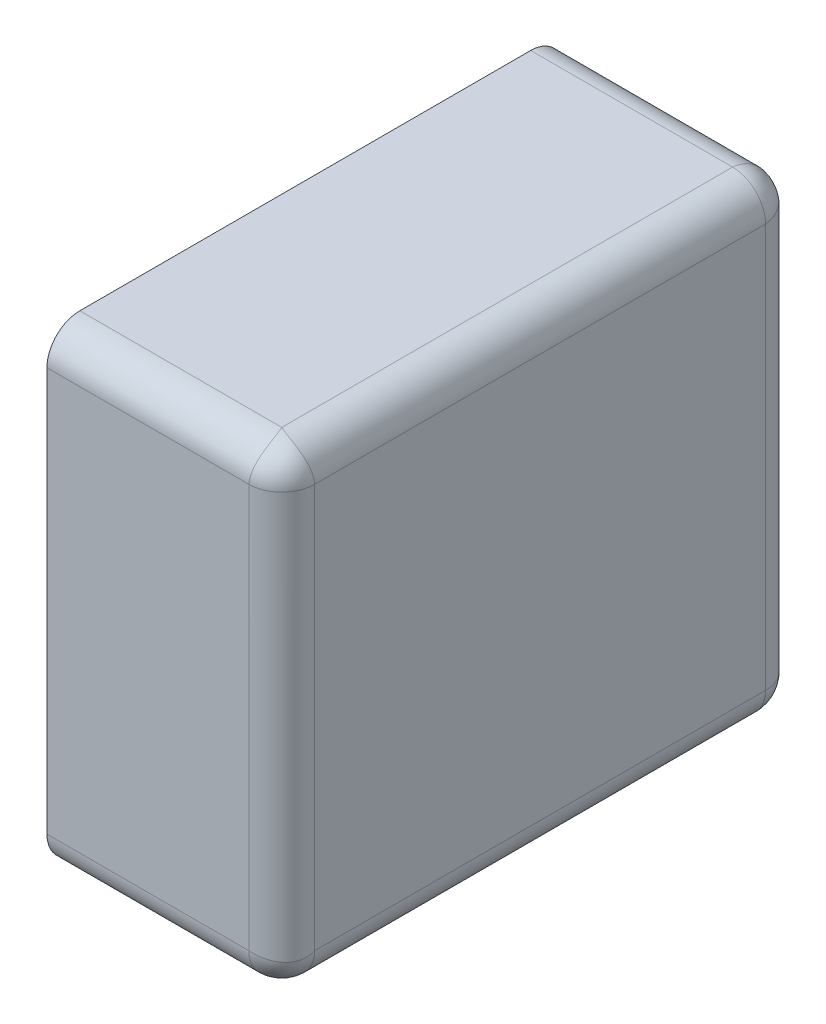
ISO-10303-21;
HEADER;
FILE_DESCRIPTION(('STEP AP214'),'2;1');
FILE_NAME('part.step','',(''),(''),'','','');
FILE_SCHEMA(('AUTOMOTIVE_DESIGN { 1 0 10303 214 1 1 1 1 }'));
ENDSEC;
DATA;
#1=APPLICATION_CONTEXT('core data for automotive mechanical design processes');
#2=APPLICATION_PROTOCOL_DEFINITION('international standard','automotive_design',2000,#1);
#3=PRODUCT_CONTEXT('',#1,'mechanical');
#4=PRODUCT('Part','Part','',(#3));
#5=PRODUCT_RELATED_PRODUCT_CATEGORY('part','',(#4));
#6=PRODUCT_DEFINITION_FORMATION('','',#4);
#7=PRODUCT_DEFINITION_CONTEXT('part definition',#1,'design');
#8=PRODUCT_DEFINITION('design','',#6,#7);
#9=PRODUCT_DEFINITION_SHAPE('','',#8);
#10=(LENGTH_UNIT() NAMED_UNIT(*) SI_UNIT(.MILLI.,.METRE.));
#11=(NAMED_UNIT(*) PLANE_ANGLE_UNIT() SI_UNIT($,.RADIAN.));
#12=(NAMED_UNIT(*) SI_UNIT($,.STERADIAN.) SOLID_ANGLE_UNIT());
#13=UNCERTAINTY_MEASURE_WITH_UNIT(LENGTH_MEASURE(1.E-05),#10,'distance_accuracy_value','');
#14=(GEOMETRIC_REPRESENTATION_CONTEXT(3) GLOBAL_UNCERTAINTY_ASSIGNED_CONTEXT((#13)) GLOBAL_UNIT_ASSIGNED_CONTEXT((#10,
#11,#12)) REPRESENTATION_CONTEXT('',''));
#15=CARTESIAN_POINT('',(0.,0.,0.));
#16=DIRECTION('',(0.,0.,1.));
#17=DIRECTION('',(1.,0.,0.));
#18=AXIS2_PLACEMENT_3D('',#15,#16,#17);
#19=CARTESIAN_POINT('',(0.465,-0.215,0.515));
#20=DIRECTION('',(-0.816496580927726,-0.408248290463863,0.408248290463864));
#21=DIRECTION('',(0.577350269189626,-0.577350269189626,0.577350269189626));
#22=AXIS2_PLACEMENT_3D('',#19,#20,#21);
#23=SPHERICAL_SURFACE('',#22,0.035);
#24=CARTESIAN_POINT('',(0.465,-0.215,0.515));
#25=DIRECTION('',(1.,0.,0.));
#26=DIRECTION('',(0.,-1.,0.));
#27=AXIS2_PLACEMENT_3D('',#24,#25,#26);
#28=CIRCLE('',#27,0.035);
#29=CARTESIAN_POINT('',(0.465,-0.215,0.55));
#30=VERTEX_POINT('',#29);
#31=CARTESIAN_POINT('',(0.465,-0.25,0.515));
#32=VERTEX_POINT('',#31);
#33=EDGE_CURVE('E11',#30,#32,#28,.T.);
#34=ORIENTED_EDGE('',*,*,#33,.T.);
#35=CARTESIAN_POINT('',(0.465,-0.215,0.515));
#36=DIRECTION('',(0.,0.,1.));
#37=DIRECTION('',(1.,0.,0.));
#38=AXIS2_PLACEMENT_3D('',#35,#36,#37);
#39=CIRCLE('',#38,0.035);
#40=CARTESIAN_POINT('',(0.5,-0.215,0.515));
#41=VERTEX_POINT('',#40);
#42=EDGE_CURVE('E25',#32,#41,#39,.T.);
#43=ORIENTED_EDGE('',*,*,#42,.T.);
#44=CARTESIAN_POINT('',(0.5,-0.215,0.515));
#45=CARTESIAN_POINT('',(0.500000001033131,-0.215111612711924,0.515243740660053));
#46=CARTESIAN_POINT('',(0.499996920052863,-0.215220629481718,0.515488666732516));
#47=CARTESIAN_POINT('',(0.4999845786552,-0.215433885748775,0.515981520070315));
#48=CARTESIAN_POINT('',(0.499975295264637,-0.215538105940278,0.516229455116116));
#49=CARTESIAN_POINT('',(0.499950487324487,-0.215741732728677,0.516728068059787));
#50=CARTESIAN_POINT('',(0.499934939549475,-0.215841119852847,0.516978752749827));
#51=CARTESIAN_POINT('',(0.499897547554466,-0.216035053958947,0.517482605532488));
#52=CARTESIAN_POINT('',(0.499875679927357,-0.216129581379983,0.517735779413988));
#53=CARTESIAN_POINT('',(0.499825597458271,-0.216313776392918,0.518244348899178));
#54=CARTESIAN_POINT('',(0.499797359090268,-0.216403424402807,0.518499749275707));
#55=CARTESIAN_POINT('',(0.49973448982718,-0.216577848292495,0.519012507395305));
#56=CARTESIAN_POINT('',(0.499699835352538,-0.216662604636929,0.519269868886963));
#57=CARTESIAN_POINT('',(0.499624092837445,-0.216827241108787,0.519786286919367));
#58=CARTESIAN_POINT('',(0.49958298122363,-0.216907101816688,0.520045346199856));
#59=CARTESIAN_POINT('',(0.49949429210846,-0.217061947217244,0.520564882823023));
#60=CARTESIAN_POINT('',(0.499446691114759,-0.217136912658727,0.520825361855251));
#61=CARTESIAN_POINT('',(0.499293860263952,-0.217354908381942,0.521609968604591));
#62=CARTESIAN_POINT('',(0.499179015986022,-0.217490140608452,0.522134442299266));
#63=CARTESIAN_POINT('',(0.498923261274146,-0.217741374273634,0.523185841676211));
#64=CARTESIAN_POINT('',(0.498782167434223,-0.217857228778892,0.523712757469804));
#65=CARTESIAN_POINT('',(0.498473823928405,-0.218070002263369,0.524766949596737));
#66=CARTESIAN_POINT('',(0.498306396078859,-0.218166781309575,0.525294202048866));
#67=CARTESIAN_POINT('',(0.497945396407614,-0.218341794125163,0.526346926690304));
#68=CARTESIAN_POINT('',(0.497751653308452,-0.218419896278802,0.526872361926918));
#69=CARTESIAN_POINT('',(0.497338126025405,-0.218558060079502,0.527919345661508));
#70=CARTESIAN_POINT('',(0.497118178897558,-0.218617999653095,0.528440845843563));
#71=CARTESIAN_POINT('',(0.496652442329535,-0.218720448187068,0.529477876626667));
#72=CARTESIAN_POINT('',(0.496406499548212,-0.218762845535282,0.529993349320268));
#73=CARTESIAN_POINT('',(0.495889066509003,-0.218830922361839,0.531016280639683));
#74=CARTESIAN_POINT('',(0.495617433584924,-0.218856501350634,0.53152367372897));
#75=CARTESIAN_POINT('',(0.495049012069484,-0.218891752157372,0.532528447342334));
#76=CARTESIAN_POINT('',(0.494752092363334,-0.218901334999283,0.533025756761079));
#77=CARTESIAN_POINT('',(0.49413358623235,-0.218905497314477,0.534008419811665));
#78=CARTESIAN_POINT('',(0.493811880919737,-0.218899999455456,0.534493698895198));
#79=CARTESIAN_POINT('',(0.493144389475274,-0.218874991771525,0.535450421844009));
#80=CARTESIAN_POINT('',(0.492798497157308,-0.218855416137075,0.535921789865429));
#81=CARTESIAN_POINT('',(0.492083313897973,-0.218803325972781,0.536848883390665));
#82=CARTESIAN_POINT('',(0.491713929747243,-0.218770756798167,0.537304533887315));
#83=CARTESIAN_POINT('',(0.490952540221432,-0.218693827906318,0.538198465147439));
#84=CARTESIAN_POINT('',(0.490560454692606,-0.218649424130771,0.538636673823173));
#85=CARTESIAN_POINT('',(0.48975453347381,-0.218550042880493,0.539494081877566));
#86=CARTESIAN_POINT('',(0.489340630573141,-0.21849503115435,0.539913214090433));
#87=CARTESIAN_POINT('',(0.488492037358285,-0.218375712170395,0.540730924439449));
#88=CARTESIAN_POINT('',(0.488057292478525,-0.218311379508136,0.54112944222653));
#89=CARTESIAN_POINT('',(0.48716806732195,-0.218174750640235,0.541904480393031));
#90=CARTESIAN_POINT('',(0.486713544648612,-0.218102436759082,0.542280949002712));
#91=CARTESIAN_POINT('',(0.48578590234657,-0.217951223461324,0.543010553093937));
#92=CARTESIAN_POINT('',(0.485312751844352,-0.217872312845424,0.543363646993976));
#93=CARTESIAN_POINT('',(0.48434907548957,-0.217709322047743,0.54404527918449));
#94=CARTESIAN_POINT('',(0.483858529479625,-0.217625235779704,0.544373787518085));
#95=CARTESIAN_POINT('',(0.482861363209515,-0.21745333933637,0.545005144400936));
#96=CARTESIAN_POINT('',(0.482354732550429,-0.21736552673908,0.545307975865549));
#97=CARTESIAN_POINT('',(0.481326773516273,-0.217187644541206,0.545886997623915));
#98=CARTESIAN_POINT('',(0.480805443403248,-0.217097574673879,0.546163184750225));
#99=CARTESIAN_POINT('',(0.479749532992511,-0.216916657514606,0.546688063108949));
#100=CARTESIAN_POINT('',(0.479214958392461,-0.216825810567597,0.546936765921816));
#101=CARTESIAN_POINT('',(0.478134072736519,-0.216644822850269,0.547405950840186));
#102=CARTESIAN_POINT('',(0.477587773473721,-0.216554681484352,0.547626459881027));
#103=CARTESIAN_POINT('',(0.476485013290226,-0.216376583863148,0.548038664969825));
#104=CARTESIAN_POINT('',(0.475928568817213,-0.216288624536903,0.548230403683926));
#105=CARTESIAN_POINT('',(0.474807148589796,-0.216116356585997,0.548584610279058));
#106=CARTESIAN_POINT('',(0.47424219241172,-0.216032040923638,0.548747136696717));
#107=CARTESIAN_POINT('',(0.473105429098777,-0.215868503907326,0.549042596740997));
#108=CARTESIAN_POINT('',(0.472533643074407,-0.215789270127003,0.549175604674644));
#109=CARTESIAN_POINT('',(0.471384943850054,-0.215637310030175,0.549411841774386));
#110=CARTESIAN_POINT('',(0.470808051651754,-0.215564564571694,0.549515160678849));
#111=CARTESIAN_POINT('',(0.469650902756467,-0.215426955223335,0.54969197165179));
#112=CARTESIAN_POINT('',(0.469070665274254,-0.21536206427015,0.549765568305483));
#113=CARTESIAN_POINT('',(0.467908614500077,-0.215241491601007,0.54988301660764));
#114=CARTESIAN_POINT('',(0.467326816974126,-0.215185773836936,0.549926986895526));
#115=CARTESIAN_POINT('',(0.46616347778738,-0.21508481781809,0.549985419922284));
#116=CARTESIAN_POINT('',(0.465581946699367,-0.215039533648617,0.550000014219777));
#117=CARTESIAN_POINT('',(0.465,-0.215,0.55));
#118=B_SPLINE_CURVE_WITH_KNOTS('',3,(#44,#45,#46,#47,#48,#49,#50,#51,#52,#53,#54,#55,#56,#57,
#58,#59,#60,#61,#62,#63,#64,#65,#66,#67,#68,#69,#70,#71,#72,#73,#74,#75,#76,#77,#78,#79,#80,#81,
#82,#83,#84,#85,#86,#87,#88,#89,#90,#91,#92,#93,#94,#95,#96,#97,#98,#99,#100,#101,#102,#103,
#104,#105,#106,#107,#108,#109,#110,#111,#112,#113,#114,#115,#116,#117),.UNSPECIFIED.,.F.,.F.,(4,
2,2,2,2,2,2,2,2,2,2,2,2,2,2,2,2,2,2,2,2,2,2,2,2,2,2,2,2,2,2,2,2,2,2,2,4),(0.,
0.00080420289442373,0.00161140112012553,0.00242162001218122,0.00323487907148142,
0.00405119199335703,0.00487056670714096,0.00569300542608977,0.00651850470709538,
0.0081784637161977,0.00985048891785632,0.0115343571056827,0.0132297631362427,0.0149363236396878,
0.0166535810697016,0.0183810080428297,0.0201180119227882,0.0218639396106708,0.0236180825069812,
0.0253796816160158,0.027147932767272,0.0289219919322403,0.0307009806181439,0.0324839913229419,
0.034270093038217,0.036058336788457,0.0378477611967304,0.0396373980678723,0.041426277981054,
0.0432134358840202,0.0449979166813543,0.0467787808088675,0.0485551097856008,0.0503260117339758,
0.0520906268573044,0.0538481328621557,0.0555977503109577),.UNSPECIFIED.);
#119=EDGE_CURVE('E285',#41,#30,#118,.T.);
#120=ORIENTED_EDGE('',*,*,#119,.T.);
#121=EDGE_LOOP('',(#34,#43,#120));
#122=FACE_BOUND('',#121,.T.);
#123=ADVANCED_FACE('F17',(#122),#23,.T.);
#124=CARTESIAN_POINT('',(0.465,-0.215,0.035));
#125=DIRECTION('',(-0.816496580927726,-0.408248290463864,-0.408248290463863));
#126=DIRECTION('',(0.577350269189626,-0.577350269189626,-0.577350269189625));
#127=AXIS2_PLACEMENT_3D('',#124,#125,#126);
#128=SPHERICAL_SURFACE('',#127,0.035);
#129=CARTESIAN_POINT('',(0.465,-0.215,0.035));
#130=DIRECTION('',(1.,0.,0.));
#131=DIRECTION('',(0.,0.,-1.));
#132=AXIS2_PLACEMENT_3D('',#129,#130,#131);
#133=CIRCLE('',#132,0.035);
#134=CARTESIAN_POINT('',(0.465,-0.25,0.035));
#135=VERTEX_POINT('',#134);
#136=CARTESIAN_POINT('',(0.465,-0.215,0.));
#137=VERTEX_POINT('',#136);
#138=EDGE_CURVE('E276',#135,#137,#133,.T.);
#139=ORIENTED_EDGE('',*,*,#138,.T.);
#140=CARTESIAN_POINT('',(0.465,-0.215,0.035));
#141=DIRECTION('',(0.,-1.,0.));
#142=DIRECTION('',(1.,0.,0.));
#143=AXIS2_PLACEMENT_3D('',#140,#141,#142);
#144=CIRCLE('',#143,0.035);
#145=CARTESIAN_POINT('',(0.5,-0.215,0.035));
#146=VERTEX_POINT('',#145);
#147=EDGE_CURVE('E299',#137,#146,#144,.T.);
#148=ORIENTED_EDGE('',*,*,#147,.T.);
#149=CARTESIAN_POINT('',(0.465,-0.215,0.035));
#150=DIRECTION('',(0.,0.,-1.));
#151=DIRECTION('',(0.,-1.,0.));
#152=AXIS2_PLACEMENT_3D('',#149,#150,#151);
#153=CIRCLE('',#152,0.035);
#154=EDGE_CURVE('E303',#146,#135,#153,.T.);
#155=ORIENTED_EDGE('',*,*,#154,.T.);
#156=EDGE_LOOP('',(#139,#148,#155));
#157=FACE_BOUND('',#156,.T.);
#158=ADVANCED_FACE('F328',(#157),#128,.T.);
#159=CARTESIAN_POINT('',(0.465,0.215,0.515));
#160=DIRECTION('',(0.408248290463863,-0.816496580927727,0.408248290463861));
#161=DIRECTION('',(0.577350269189626,0.577350269189624,0.577350269189627));
#162=AXIS2_PLACEMENT_3D('',#159,#160,#161);
#163=SPHERICAL_SURFACE('',#162,0.035);
#164=CARTESIAN_POINT('',(0.465,0.215,0.515));
#165=DIRECTION('',(0.,1.,0.));
#166=DIRECTION('',(1.,0.,0.));
#167=AXIS2_PLACEMENT_3D('',#164,#165,#166);
#168=CIRCLE('',#167,0.035);
#169=CARTESIAN_POINT('',(0.465,0.215,0.55));
#170=VERTEX_POINT('',#169);
#171=CARTESIAN_POINT('',(0.5,0.215,0.515));
#172=VERTEX_POINT('',#171);
#173=EDGE_CURVE('E305',#170,#172,#168,.T.);
#174=ORIENTED_EDGE('',*,*,#173,.T.);
#175=CARTESIAN_POINT('',(0.5,0.215,0.515));
#176=CARTESIAN_POINT('',(0.500000014219777,0.215581946699367,0.515039533648617));
#177=CARTESIAN_POINT('',(0.499985419922284,0.21616347778738,0.51508481781809));
#178=CARTESIAN_POINT('',(0.499926986895526,0.217326816974126,0.515185773836936));
#179=CARTESIAN_POINT('',(0.499883016607641,0.217908614500077,0.515241491601007));
#180=CARTESIAN_POINT('',(0.499765568305483,0.219070665274254,0.51536206427015));
#181=CARTESIAN_POINT('',(0.49969197165179,0.219650902756467,0.515426955223335));
#182=CARTESIAN_POINT('',(0.499515160678849,0.220808051651754,0.515564564571695));
#183=CARTESIAN_POINT('',(0.499411841774386,0.221384943850054,0.515637310030175));
#184=CARTESIAN_POINT('',(0.499175604674644,0.222533643074407,0.515789270127003));
#185=CARTESIAN_POINT('',(0.499042596740997,0.223105429098777,0.515868503907326));
#186=CARTESIAN_POINT('',(0.498747136696717,0.22424219241172,0.516032040923638));
#187=CARTESIAN_POINT('',(0.498584610279058,0.224807148589796,0.516116356585997));
#188=CARTESIAN_POINT('',(0.498230403683926,0.225928568817213,0.516288624536903));
#189=CARTESIAN_POINT('',(0.498038664969825,0.226485013290226,0.516376583863148));
#190=CARTESIAN_POINT('',(0.497626459881027,0.227587773473721,0.516554681484352));
#191=CARTESIAN_POINT('',(0.497405950840186,0.228134072736519,0.516644822850269));
#192=CARTESIAN_POINT('',(0.496936765921816,0.229214958392461,0.516825810567597));
#193=CARTESIAN_POINT('',(0.496688063108949,0.229749532992511,0.516916657514606));
#194=CARTESIAN_POINT('',(0.496163184750225,0.230805443403248,0.51709757467388));
#195=CARTESIAN_POINT('',(0.495886997623915,0.231326773516273,0.517187644541206));
#196=CARTESIAN_POINT('',(0.495307975865549,0.232354732550429,0.51736552673908));
#197=CARTESIAN_POINT('',(0.495005144400936,0.232861363209515,0.51745333933637));
#198=CARTESIAN_POINT('',(0.494373787518085,0.233858529479625,0.517625235779704));
#199=CARTESIAN_POINT('',(0.49404527918449,0.23434907548957,0.517709322047743));
#200=CARTESIAN_POINT('',(0.493363646993976,0.235312751844352,0.517872312845424));
#201=CARTESIAN_POINT('',(0.493010553093937,0.23578590234657,0.517951223461324));
#202=CARTESIAN_POINT('',(0.492280949002712,0.236713544648612,0.518102436759082));
#203=CARTESIAN_POINT('',(0.491904480393031,0.23716806732195,0.518174750640235));
#204=CARTESIAN_POINT('',(0.49112944222653,0.238057292478525,0.518311379508136));
#205=CARTESIAN_POINT('',(0.490730924439449,0.238492037358285,0.518375712170396));
#206=CARTESIAN_POINT('',(0.489913214090433,0.239340630573141,0.51849503115435));
#207=CARTESIAN_POINT('',(0.489494081877566,0.23975453347381,0.518550042880493));
#208=CARTESIAN_POINT('',(0.488636673823173,0.240560454692606,0.518649424130772));
#209=CARTESIAN_POINT('',(0.488198465147439,0.240952540221432,0.518693827906318));
#210=CARTESIAN_POINT('',(0.487304533887315,0.241713929747243,0.518770756798168));
#211=CARTESIAN_POINT('',(0.486848883390665,0.242083313897973,0.518803325972781));
#212=CARTESIAN_POINT('',(0.485921789865429,0.242798497157308,0.518855416137075));
#213=CARTESIAN_POINT('',(0.485450421844009,0.243144389475274,0.518874991771525));
#214=CARTESIAN_POINT('',(0.484493698895198,0.243811880919737,0.518899999455456));
#215=CARTESIAN_POINT('',(0.484008419811665,0.24413358623235,0.518905497314477));
#216=CARTESIAN_POINT('',(0.483025756761079,0.244752092363333,0.518901334999283));
#217=CARTESIAN_POINT('',(0.482528447342334,0.245049012069484,0.518891752157373));
#218=CARTESIAN_POINT('',(0.48152367372897,0.245617433584924,0.518856501350634));
#219=CARTESIAN_POINT('',(0.481016280639683,0.245889066509003,0.518830922361839));
#220=CARTESIAN_POINT('',(0.479993349320268,0.246406499548212,0.518762845535282));
#221=CARTESIAN_POINT('',(0.479477876626667,0.246652442329535,0.518720448187068));
#222=CARTESIAN_POINT('',(0.478440845843563,0.247118178897558,0.518617999653095));
#223=CARTESIAN_POINT('',(0.477919345661508,0.247338126025405,0.518558060079502));
#224=CARTESIAN_POINT('',(0.476872361926918,0.247751653308452,0.518419896278803));
#225=CARTESIAN_POINT('',(0.476346926690304,0.247945396407614,0.518341794125163));
#226=CARTESIAN_POINT('',(0.475294202048866,0.248306396078859,0.518166781309575));
#227=CARTESIAN_POINT('',(0.474766949596737,0.248473823928405,0.518070002263369));
#228=CARTESIAN_POINT('',(0.473712757469804,0.248782167434223,0.517857228778892));
#229=CARTESIAN_POINT('',(0.473185841676211,0.248923261274146,0.517741374273634));
#230=CARTESIAN_POINT('',(0.472134442299266,0.249179015986022,0.517490140608452));
#231=CARTESIAN_POINT('',(0.471609968604591,0.249293860263952,0.517354908381942));
#232=CARTESIAN_POINT('',(0.470825361855251,0.249446691114759,0.517136912658727));
#233=CARTESIAN_POINT('',(0.470564882823023,0.24949429210846,0.517061947217244));
#234=CARTESIAN_POINT('',(0.470045346199856,0.24958298122363,0.516907101816688));
#235=CARTESIAN_POINT('',(0.469786286919367,0.249624092837445,0.516827241108787));
#236=CARTESIAN_POINT('',(0.469269868886963,0.249699835352538,0.516662604636929));
#237=CARTESIAN_POINT('',(0.469012507395305,0.24973448982718,0.516577848292495));
#238=CARTESIAN_POINT('',(0.468499749275707,0.249797359090267,0.516403424402808));
#239=CARTESIAN_POINT('',(0.468244348899179,0.249825597458271,0.516313776392919));
#240=CARTESIAN_POINT('',(0.467735779413988,0.249875679927356,0.516129581379983));
#241=CARTESIAN_POINT('',(0.467482605532488,0.249897547554466,0.516035053958947));
#242=CARTESIAN_POINT('',(0.466978752749827,0.249934939549475,0.515841119852847));
#243=CARTESIAN_POINT('',(0.466728068059787,0.249950487324487,0.515741732728677));
#244=CARTESIAN_POINT('',(0.466229455116116,0.249975295264637,0.515538105940278));
#245=CARTESIAN_POINT('',(0.465981520070315,0.2499845786552,0.515433885748775));
#246=CARTESIAN_POINT('',(0.465488666732516,0.249996920052863,0.515220629481718));
#247=CARTESIAN_POINT('',(0.465243740660053,0.250000001033131,0.515111612711924));
#248=CARTESIAN_POINT('',(0.465,0.25,0.515));
#249=B_SPLINE_CURVE_WITH_KNOTS('',3,(#175,#176,#177,#178,#179,#180,#181,#182,#183,#184,#185,
#186,#187,#188,#189,#190,#191,#192,#193,#194,#195,#196,#197,#198,#199,#200,#201,#202,#203,#204,
#205,#206,#207,#208,#209,#210,#211,#212,#213,#214,#215,#216,#217,#218,#219,#220,#221,#222,#223,
#224,#225,#226,#227,#228,#229,#230,#231,#232,#233,#234,#235,#236,#237,#238,#239,#240,#241,#242,
#243,#244,#245,#246,#247,#248),.UNSPECIFIED.,.F.,.F.,(4,2,2,2,2,2,2,2,2,2,2,2,2,2,2,2,2,2,2,2,2,
2,2,2,2,2,2,2,2,2,2,2,2,2,2,2,4),(0.,0.00174961744880201,0.00350712345365322,0.0052717385769819,
0.00704264052535691,0.00881896950209017,0.0105998336296034,0.0123843144269376,
0.0141714723299037,0.0159603522430853,0.0177499891142273,0.0195394135225007,0.0213276572727407,
0.0231137589880158,0.0248967696928138,0.0266757583787174,0.0284498175436857,0.0302180686949419,
0.0319796678039765,0.0337338107002869,0.0354797383881695,0.037216742268128,0.0389441692412561,
0.0406614266712698,0.0423679871747149,0.044063393205275,0.0457472613931013,0.04741928659476,
0.0490792456038623,0.049904744884868,0.0507271836038167,0.0515465583176007,0.0523628712394763,
0.0531761302987764,0.0539863491908321,0.0547935474165339,0.0555977503109577),.UNSPECIFIED.);
#250=CARTESIAN_POINT('',(0.465,0.25,0.515));
#251=VERTEX_POINT('',#250);
#252=EDGE_CURVE('E309',#172,#251,#249,.T.);
#253=ORIENTED_EDGE('',*,*,#252,.T.);
#254=CARTESIAN_POINT('',(0.465,0.25,0.515));
#255=CARTESIAN_POINT('',(0.465111612711924,0.250000001033131,0.515243740660053));
#256=CARTESIAN_POINT('',(0.465220629481718,0.249996920052863,0.515488666732516));
#257=CARTESIAN_POINT('',(0.465433885748775,0.2499845786552,0.515981520070315));
#258=CARTESIAN_POINT('',(0.465538105940278,0.249975295264637,0.516229455116116));
#259=CARTESIAN_POINT('',(0.465741732728677,0.249950487324487,0.516728068059787));
#260=CARTESIAN_POINT('',(0.465841119852847,0.249934939549475,0.516978752749827));
#261=CARTESIAN_POINT('',(0.466035053958947,0.249897547554466,0.517482605532488));
#262=CARTESIAN_POINT('',(0.466129581379983,0.249875679927356,0.517735779413988));
#263=CARTESIAN_POINT('',(0.466313776392918,0.249825597458271,0.518244348899179));
#264=CARTESIAN_POINT('',(0.466403424402808,0.249797359090267,0.518499749275708));
#265=CARTESIAN_POINT('',(0.466577848292495,0.24973448982718,0.519012507395305));
#266=CARTESIAN_POINT('',(0.466662604636929,0.249699835352538,0.519269868886963));
#267=CARTESIAN_POINT('',(0.466827241108787,0.249624092837445,0.519786286919367));
#268=CARTESIAN_POINT('',(0.466907101816688,0.24958298122363,0.520045346199856));
#269=CARTESIAN_POINT('',(0.467061947217244,0.24949429210846,0.520564882823023));
#270=CARTESIAN_POINT('',(0.467136912658727,0.249446691114759,0.520825361855251));
#271=CARTESIAN_POINT('',(0.467354908381942,0.249293860263952,0.521609968604591));
#272=CARTESIAN_POINT('',(0.467490140608452,0.249179015986022,0.522134442299266));
#273=CARTESIAN_POINT('',(0.467741374273634,0.248923261274146,0.523185841676211));
#274=CARTESIAN_POINT('',(0.467857228778892,0.248782167434223,0.523712757469804));
#275=CARTESIAN_POINT('',(0.468070002263369,0.248473823928405,0.524766949596737));
#276=CARTESIAN_POINT('',(0.468166781309575,0.248306396078859,0.525294202048866));
#277=CARTESIAN_POINT('',(0.468341794125163,0.247945396407614,0.526346926690304));
#278=CARTESIAN_POINT('',(0.468419896278802,0.247751653308452,0.526872361926918));
#279=CARTESIAN_POINT('',(0.468558060079502,0.247338126025405,0.527919345661508));
#280=CARTESIAN_POINT('',(0.468617999653095,0.247118178897558,0.528440845843563));
#281=CARTESIAN_POINT('',(0.468720448187068,0.246652442329535,0.529477876626667));
#282=CARTESIAN_POINT('',(0.468762845535282,0.246406499548212,0.529993349320268));
#283=CARTESIAN_POINT('',(0.468830922361839,0.245889066509003,0.531016280639683));
#284=CARTESIAN_POINT('',(0.468856501350634,0.245617433584924,0.53152367372897));
#285=CARTESIAN_POINT('',(0.468891752157373,0.245049012069484,0.532528447342334));
#286=CARTESIAN_POINT('',(0.468901334999283,0.244752092363333,0.533025756761079));
#287=CARTESIAN_POINT('',(0.468905497314477,0.24413358623235,0.534008419811665));
#288=CARTESIAN_POINT('',(0.468899999455456,0.243811880919737,0.534493698895198));
#289=CARTESIAN_POINT('',(0.468874991771525,0.243144389475274,0.535450421844009));
#290=CARTESIAN_POINT('',(0.468855416137075,0.242798497157308,0.535921789865429));
#291=CARTESIAN_POINT('',(0.468803325972781,0.242083313897973,0.536848883390665));
#292=CARTESIAN_POINT('',(0.468770756798167,0.241713929747243,0.537304533887315));
#293=CARTESIAN_POINT('',(0.468693827906318,0.240952540221432,0.538198465147439));
#294=CARTESIAN_POINT('',(0.468649424130771,0.240560454692606,0.538636673823173));
#295=CARTESIAN_POINT('',(0.468550042880493,0.23975453347381,0.539494081877566));
#296=CARTESIAN_POINT('',(0.46849503115435,0.239340630573141,0.539913214090433));
#297=CARTESIAN_POINT('',(0.468375712170395,0.238492037358285,0.540730924439449));
#298=CARTESIAN_POINT('',(0.468311379508136,0.238057292478525,0.54112944222653));
#299=CARTESIAN_POINT('',(0.468174750640235,0.23716806732195,0.541904480393031));
#300=CARTESIAN_POINT('',(0.468102436759082,0.236713544648612,0.542280949002712));
#301=CARTESIAN_POINT('',(0.467951223461324,0.23578590234657,0.543010553093937));
#302=CARTESIAN_POINT('',(0.467872312845424,0.235312751844352,0.543363646993976));
#303=CARTESIAN_POINT('',(0.467709322047743,0.23434907548957,0.54404527918449));
#304=CARTESIAN_POINT('',(0.467625235779704,0.233858529479625,0.544373787518085));
#305=CARTESIAN_POINT('',(0.46745333933637,0.232861363209515,0.545005144400936));
#306=CARTESIAN_POINT('',(0.46736552673908,0.232354732550429,0.545307975865549));
#307=CARTESIAN_POINT('',(0.467187644541206,0.231326773516273,0.545886997623915));
#308=CARTESIAN_POINT('',(0.46709757467388,0.230805443403248,0.546163184750225));
#309=CARTESIAN_POINT('',(0.466916657514606,0.229749532992511,0.546688063108949));
#310=CARTESIAN_POINT('',(0.466825810567597,0.229214958392461,0.546936765921816));
#311=CARTESIAN_POINT('',(0.466644822850269,0.228134072736519,0.547405950840186));
#312=CARTESIAN_POINT('',(0.466554681484352,0.227587773473721,0.547626459881027));
#313=CARTESIAN_POINT('',(0.466376583863148,0.226485013290226,0.548038664969825));
#314=CARTESIAN_POINT('',(0.466288624536903,0.225928568817213,0.548230403683926));
#315=CARTESIAN_POINT('',(0.466116356585997,0.224807148589796,0.548584610279058));
#316=CARTESIAN_POINT('',(0.466032040923638,0.22424219241172,0.548747136696717));
#317=CARTESIAN_POINT('',(0.465868503907326,0.223105429098777,0.549042596740997));
#318=CARTESIAN_POINT('',(0.465789270127003,0.222533643074407,0.549175604674644));
#319=CARTESIAN_POINT('',(0.465637310030175,0.221384943850054,0.549411841774386));
#320=CARTESIAN_POINT('',(0.465564564571695,0.220808051651754,0.549515160678849));
#321=CARTESIAN_POINT('',(0.465426955223335,0.219650902756467,0.54969197165179));
#322=CARTESIAN_POINT('',(0.46536206427015,0.219070665274254,0.549765568305483));
#323=CARTESIAN_POINT('',(0.465241491601007,0.217908614500077,0.54988301660764));
#324=CARTESIAN_POINT('',(0.465185773836936,0.217326816974126,0.549926986895526));
#325=CARTESIAN_POINT('',(0.46508481781809,0.21616347778738,0.549985419922284));
#326=CARTESIAN_POINT('',(0.465039533648617,0.215581946699367,0.550000014219777));
#327=CARTESIAN_POINT('',(0.465,0.215,0.55));
#328=B_SPLINE_CURVE_WITH_KNOTS('',3,(#254,#255,#256,#257,#258,#259,#260,#261,#262,#263,#264,
#265,#266,#267,#268,#269,#270,#271,#272,#273,#274,#275,#276,#277,#278,#279,#280,#281,#282,#283,
#284,#285,#286,#287,#288,#289,#290,#291,#292,#293,#294,#295,#296,#297,#298,#299,#300,#301,#302,
#303,#304,#305,#306,#307,#308,#309,#310,#311,#312,#313,#314,#315,#316,#317,#318,#319,#320,#321,
#322,#323,#324,#325,#326,#327),.UNSPECIFIED.,.F.,.F.,(4,2,2,2,2,2,2,2,2,2,2,2,2,2,2,2,2,2,2,2,2,
2,2,2,2,2,2,2,2,2,2,2,2,2,2,2,4),(0.,0.000804202894423741,0.00161140112012554,
0.00242162001218123,0.00323487907148142,0.00405119199335704,0.00487056670714097,
0.00569300542608968,0.00651850470709528,0.0081784637161977,0.00985048891785633,
0.0115343571056826,0.0132297631362427,0.0149363236396878,0.0166535810697015,0.0183810080428296,
0.0201180119227881,0.0218639396106708,0.0236180825069812,0.0253796816160157,0.027147932767272,
0.0289219919322403,0.0307009806181438,0.0324839913229419,0.0342700930382169,0.0360583367884569,
0.0378477611967303,0.0396373980678722,0.0414262779810539,0.0432134358840201,0.0449979166813542,
0.0467787808088675,0.0485551097856007,0.0503260117339757,0.0520906268573044,0.0538481328621556,
0.0555977503109576),.UNSPECIFIED.);
#329=EDGE_CURVE('E248',#251,#170,#328,.T.);
#330=ORIENTED_EDGE('',*,*,#329,.T.);
#331=EDGE_LOOP('',(#174,#253,#330));
#332=FACE_BOUND('',#331,.T.);
#333=ADVANCED_FACE('F320',(#332),#163,.T.);
#334=CARTESIAN_POINT('',(0.465,0.215,0.035));
#335=DIRECTION('',(-0.408248290463864,-0.408248290463862,-0.816496580927726));
#336=DIRECTION('',(0.577350269189626,0.577350269189625,-0.577350269189626));
#337=AXIS2_PLACEMENT_3D('',#334,#335,#336);
#338=SPHERICAL_SURFACE('',#337,0.035);
#339=CARTESIAN_POINT('',(0.465,0.215,0.035));
#340=DIRECTION('',(0.,0.,-1.));
#341=DIRECTION('',(1.,0.,0.));
#342=AXIS2_PLACEMENT_3D('',#339,#340,#341);
#343=CIRCLE('',#342,0.035);
#344=CARTESIAN_POINT('',(0.465,0.25,0.035));
#345=VERTEX_POINT('',#344);
#346=CARTESIAN_POINT('',(0.5,0.215,0.035));
#347=VERTEX_POINT('',#346);
#348=EDGE_CURVE('E246',#345,#347,#343,.T.);
#349=ORIENTED_EDGE('',*,*,#348,.T.);
#350=CARTESIAN_POINT('',(0.5,0.215,0.035));
#351=CARTESIAN_POINT('',(0.500000014219777,0.215039533648617,0.034418053300633));
#352=CARTESIAN_POINT('',(0.499985419922284,0.21508481781809,0.0338365222126202));
#353=CARTESIAN_POINT('',(0.499926986895526,0.215185773836936,0.0326731830258739));
#354=CARTESIAN_POINT('',(0.499883016607641,0.215241491601007,0.0320913854999232));
#355=CARTESIAN_POINT('',(0.499765568305483,0.21536206427015,0.0309293347257464));
#356=CARTESIAN_POINT('',(0.49969197165179,0.215426955223335,0.0303490972435331));
#357=CARTESIAN_POINT('',(0.499515160678849,0.215564564571694,0.0291919483482462));
#358=CARTESIAN_POINT('',(0.499411841774386,0.215637310030175,0.0286150561499456));
#359=CARTESIAN_POINT('',(0.499175604674644,0.215789270127003,0.0274663569255934));
#360=CARTESIAN_POINT('',(0.499042596740997,0.215868503907326,0.0268945709012229));
#361=CARTESIAN_POINT('',(0.498747136696717,0.216032040923638,0.0257578075882802));
#362=CARTESIAN_POINT('',(0.498584610279058,0.216116356585997,0.0251928514102044));
#363=CARTESIAN_POINT('',(0.498230403683926,0.216288624536903,0.0240714311827869));
#364=CARTESIAN_POINT('',(0.498038664969825,0.216376583863148,0.0235149867097744));
#365=CARTESIAN_POINT('',(0.497626459881027,0.216554681484352,0.0224122265262787));
#366=CARTESIAN_POINT('',(0.497405950840186,0.216644822850269,0.0218659272634811));
#367=CARTESIAN_POINT('',(0.496936765921816,0.216825810567597,0.0207850416075391));
#368=CARTESIAN_POINT('',(0.496688063108949,0.216916657514606,0.0202504670074887));
#369=CARTESIAN_POINT('',(0.496163184750225,0.21709757467388,0.0191945565967516));
#370=CARTESIAN_POINT('',(0.495886997623915,0.217187644541206,0.0186732264837271));
#371=CARTESIAN_POINT('',(0.495307975865549,0.21736552673908,0.0176452674495711));
#372=CARTESIAN_POINT('',(0.495005144400936,0.21745333933637,0.0171386367904849));
#373=CARTESIAN_POINT('',(0.494373787518085,0.217625235779704,0.0161414705203753));
#374=CARTESIAN_POINT('',(0.49404527918449,0.217709322047743,0.0156509245104299));
#375=CARTESIAN_POINT('',(0.493363646993976,0.217872312845424,0.0146872481556479));
#376=CARTESIAN_POINT('',(0.493010553093937,0.217951223461324,0.0142140976534304));
#377=CARTESIAN_POINT('',(0.492280949002712,0.218102436759082,0.0132864553513876));
#378=CARTESIAN_POINT('',(0.491904480393031,0.218174750640235,0.0128319326780499));
#379=CARTESIAN_POINT('',(0.49112944222653,0.218311379508136,0.0119427075214746));
#380=CARTESIAN_POINT('',(0.490730924439449,0.218375712170395,0.0115079626417149));
#381=CARTESIAN_POINT('',(0.489913214090433,0.21849503115435,0.010659369426859));
#382=CARTESIAN_POINT('',(0.489494081877566,0.218550042880493,0.0102454665261899));
#383=CARTESIAN_POINT('',(0.488636673823173,0.218649424130771,0.0094395453073941));
#384=CARTESIAN_POINT('',(0.488198465147439,0.218693827906318,0.00904745977856766));
#385=CARTESIAN_POINT('',(0.487304533887315,0.218770756798167,0.00828607025275674));
#386=CARTESIAN_POINT('',(0.486848883390665,0.218803325972781,0.00791668610202662));
#387=CARTESIAN_POINT('',(0.485921789865429,0.218855416137075,0.00720150284269199));
#388=CARTESIAN_POINT('',(0.485450421844009,0.218874991771525,0.00685561052472573));
#389=CARTESIAN_POINT('',(0.484493698895198,0.218899999455456,0.00618811908026279));
#390=CARTESIAN_POINT('',(0.484008419811665,0.218905497314477,0.00586641376765002));
#391=CARTESIAN_POINT('',(0.483025756761079,0.218901334999283,0.00524790763666659));
#392=CARTESIAN_POINT('',(0.482528447342334,0.218891752157372,0.0049509879305157));
#393=CARTESIAN_POINT('',(0.48152367372897,0.218856501350634,0.00438256641507607));
#394=CARTESIAN_POINT('',(0.481016280639683,0.218830922361839,0.00411093349099745));
#395=CARTESIAN_POINT('',(0.479993349320268,0.218762845535282,0.00359350045178807));
#396=CARTESIAN_POINT('',(0.479477876626667,0.218720448187068,0.00334755767046512));
#397=CARTESIAN_POINT('',(0.478440845843563,0.218617999653095,0.00288182110244224));
#398=CARTESIAN_POINT('',(0.477919345661508,0.218558060079502,0.00266187397459509));
#399=CARTESIAN_POINT('',(0.476872361926918,0.218419896278802,0.0022483466915483));
#400=CARTESIAN_POINT('',(0.476346926690304,0.218341794125163,0.00205460359238605));
#401=CARTESIAN_POINT('',(0.475294202048866,0.218166781309575,0.00169360392114075));
#402=CARTESIAN_POINT('',(0.474766949596737,0.218070002263369,0.00152617607159482));
#403=CARTESIAN_POINT('',(0.473712757469804,0.217857228778892,0.00121783256577716));
#404=CARTESIAN_POINT('',(0.473185841676211,0.217741374273634,0.0010767387258538));
#405=CARTESIAN_POINT('',(0.472134442299266,0.217490140608452,0.00082098401397811));
#406=CARTESIAN_POINT('',(0.471609968604591,0.217354908381942,0.000706139736048336));
#407=CARTESIAN_POINT('',(0.470825361855251,0.217136912658727,0.000553308885241227));
#408=CARTESIAN_POINT('',(0.470564882823023,0.217061947217244,0.000505707891539695));
#409=CARTESIAN_POINT('',(0.470045346199856,0.216907101816688,0.000417018776369788));
#410=CARTESIAN_POINT('',(0.469786286919367,0.216827241108787,0.000375907162554592));
#411=CARTESIAN_POINT('',(0.469269868886963,0.216662604636929,0.000300164647462441));
#412=CARTESIAN_POINT('',(0.469012507395305,0.216577848292495,0.000265510172820459));
#413=CARTESIAN_POINT('',(0.468499749275707,0.216403424402807,0.00020264090973253));
#414=CARTESIAN_POINT('',(0.468244348899179,0.216313776392918,0.000174402541729468));
#415=CARTESIAN_POINT('',(0.467735779413988,0.216129581379983,0.000124320072643499));
#416=CARTESIAN_POINT('',(0.467482605532488,0.216035053958947,0.00010245244553411));
#417=CARTESIAN_POINT('',(0.466978752749827,0.215841119852847,6.50604505245502E-05));
#418=CARTESIAN_POINT('',(0.466728068059787,0.215741732728677,4.95126755131801E-05));
#419=CARTESIAN_POINT('',(0.466229455116116,0.215538105940278,2.47047353632997E-05));
#420=CARTESIAN_POINT('',(0.465981520070315,0.215433885748775,1.54213448005002E-05));
#421=CARTESIAN_POINT('',(0.465488666732516,0.215220629481718,3.07994713752507E-06));
#422=CARTESIAN_POINT('',(0.465243740660052,0.215111612711924,-1.03313121520424E-09));
#423=CARTESIAN_POINT('',(0.465,0.215,0.));
#424=B_SPLINE_CURVE_WITH_KNOTS('',3,(#350,#351,#352,#353,#354,#355,#356,#357,#358,#359,#360,
#361,#362,#363,#364,#365,#366,#367,#368,#369,#370,#371,#372,#373,#374,#375,#376,#377,#378,#379,
#380,#381,#382,#383,#384,#385,#386,#387,#388,#389,#390,#391,#392,#393,#394,#395,#396,#397,#398,
#399,#400,#401,#402,#403,#404,#405,#406,#407,#408,#409,#410,#411,#412,#413,#414,#415,#416,#417,
#418,#419,#420,#421,#422,#423),.UNSPECIFIED.,.F.,.F.,(4,2,2,2,2,2,2,2,2,2,2,2,2,2,2,2,2,2,2,2,2,
2,2,2,2,2,2,2,2,2,2,2,2,2,2,2,4),(0.,0.00174961744880199,0.00350712345365321,
0.00527173857698189,0.00704264052535691,0.00881896950209018,0.0105998336296034,
0.0123843144269376,0.0141714723299037,0.0159603522430853,0.0177499891142273,0.0195394135225007,
0.0213276572727407,0.0231137589880158,0.0248967696928138,0.0266757583787174,0.0284498175436857,
0.0302180686949419,0.0319796678039764,0.0337338107002869,0.0354797383881695,0.037216742268128,
0.0389441692412561,0.0406614266712698,0.042367987174715,0.044063393205275,0.0457472613931014,
0.04741928659476,0.0490792456038624,0.049904744884868,0.0507271836038167,0.0515465583176007,
0.0523628712394763,0.0531761302987764,0.0539863491908321,0.054793547416534,0.0555977503109577),.UNSPECIFIED.);
#425=CARTESIAN_POINT('',(0.465,0.215,0.));
#426=VERTEX_POINT('',#425);
#427=EDGE_CURVE('E232',#347,#426,#424,.T.);
#428=ORIENTED_EDGE('',*,*,#427,.T.);
#429=CARTESIAN_POINT('',(0.465,0.215,0.));
#430=CARTESIAN_POINT('',(0.465111612711924,0.215243740660052,-1.03313121586323E-09));
#431=CARTESIAN_POINT('',(0.465220629481718,0.215488666732516,3.07994713752451E-06));
#432=CARTESIAN_POINT('',(0.465433885748775,0.215981520070315,1.54213448005003E-05));
#433=CARTESIAN_POINT('',(0.465538105940278,0.216229455116116,2.47047353632999E-05));
#434=CARTESIAN_POINT('',(0.465741732728677,0.216728068059787,4.95126755131809E-05));
#435=CARTESIAN_POINT('',(0.465841119852847,0.216978752749827,6.50604505245519E-05));
#436=CARTESIAN_POINT('',(0.466035053958947,0.217482605532488,0.000102452445534109));
#437=CARTESIAN_POINT('',(0.466129581379983,0.217735779413988,0.000124320072643493));
#438=CARTESIAN_POINT('',(0.466313776392918,0.218244348899179,0.000174402541729459));
#439=CARTESIAN_POINT('',(0.466403424402808,0.218499749275707,0.000202640909732521));
#440=CARTESIAN_POINT('',(0.466577848292495,0.219012507395305,0.000265510172820455));
#441=CARTESIAN_POINT('',(0.466662604636929,0.219269868886962,0.000300164647462441));
#442=CARTESIAN_POINT('',(0.466827241108787,0.219786286919367,0.000375907162554594));
#443=CARTESIAN_POINT('',(0.466907101816688,0.220045346199856,0.000417018776369787));
#444=CARTESIAN_POINT('',(0.467061947217244,0.220564882823023,0.000505707891539695));
#445=CARTESIAN_POINT('',(0.467136912658727,0.220825361855251,0.00055330888524123));
#446=CARTESIAN_POINT('',(0.467354908381942,0.221609968604591,0.000706139736048348));
#447=CARTESIAN_POINT('',(0.467490140608452,0.222134442299266,0.000820984013978128));
#448=CARTESIAN_POINT('',(0.467741374273634,0.223185841676211,0.00107673872585382));
#449=CARTESIAN_POINT('',(0.467857228778892,0.223712757469804,0.00121783256577717));
#450=CARTESIAN_POINT('',(0.468070002263369,0.224766949596737,0.00152617607159482));
#451=CARTESIAN_POINT('',(0.468166781309575,0.225294202048866,0.00169360392114075));
#452=CARTESIAN_POINT('',(0.468341794125163,0.226346926690304,0.00205460359238606));
#453=CARTESIAN_POINT('',(0.468419896278802,0.226872361926918,0.0022483466915483));
#454=CARTESIAN_POINT('',(0.468558060079502,0.227919345661508,0.00266187397459509));
#455=CARTESIAN_POINT('',(0.468617999653095,0.228440845843563,0.00288182110244224));
#456=CARTESIAN_POINT('',(0.468720448187068,0.229477876626666,0.00334755767046512));
#457=CARTESIAN_POINT('',(0.468762845535282,0.229993349320268,0.00359350045178805));
#458=CARTESIAN_POINT('',(0.468830922361839,0.231016280639683,0.00411093349099743));
#459=CARTESIAN_POINT('',(0.468856501350634,0.23152367372897,0.00438256641507605));
#460=CARTESIAN_POINT('',(0.468891752157373,0.232528447342334,0.00495098793051569));
#461=CARTESIAN_POINT('',(0.468901334999283,0.233025756761079,0.00524790763666659));
#462=CARTESIAN_POINT('',(0.468905497314477,0.234008419811665,0.00586641376765002));
#463=CARTESIAN_POINT('',(0.468899999455456,0.234493698895198,0.00618811908026279));
#464=CARTESIAN_POINT('',(0.468874991771525,0.235450421844009,0.00685561052472573));
#465=CARTESIAN_POINT('',(0.468855416137075,0.235921789865429,0.007201502842692));
#466=CARTESIAN_POINT('',(0.468803325972781,0.236848883390665,0.00791668610202664));
#467=CARTESIAN_POINT('',(0.468770756798167,0.237304533887315,0.00828607025275677));
#468=CARTESIAN_POINT('',(0.468693827906318,0.238198465147439,0.00904745977856769));
#469=CARTESIAN_POINT('',(0.468649424130771,0.238636673823173,0.00943954530739411));
#470=CARTESIAN_POINT('',(0.468550042880493,0.239494081877566,0.0102454665261899));
#471=CARTESIAN_POINT('',(0.46849503115435,0.239913214090433,0.010659369426859));
#472=CARTESIAN_POINT('',(0.468375712170396,0.240730924439449,0.0115079626417149));
#473=CARTESIAN_POINT('',(0.468311379508136,0.24112944222653,0.0119427075214746));
#474=CARTESIAN_POINT('',(0.468174750640235,0.241904480393031,0.0128319326780499));
#475=CARTESIAN_POINT('',(0.468102436759082,0.242280949002712,0.0132864553513876));
#476=CARTESIAN_POINT('',(0.467951223461324,0.243010553093937,0.0142140976534304));
#477=CARTESIAN_POINT('',(0.467872312845424,0.243363646993975,0.0146872481556479));
#478=CARTESIAN_POINT('',(0.467709322047743,0.24404527918449,0.0156509245104299));
#479=CARTESIAN_POINT('',(0.467625235779704,0.244373787518085,0.0161414705203753));
#480=CARTESIAN_POINT('',(0.46745333933637,0.245005144400936,0.0171386367904849));
#481=CARTESIAN_POINT('',(0.46736552673908,0.245307975865549,0.017645267449571));
#482=CARTESIAN_POINT('',(0.467187644541206,0.245886997623915,0.0186732264837271));
#483=CARTESIAN_POINT('',(0.46709757467388,0.246163184750225,0.0191945565967516));
#484=CARTESIAN_POINT('',(0.466916657514606,0.246688063108948,0.0202504670074887));
#485=CARTESIAN_POINT('',(0.466825810567597,0.246936765921816,0.020785041607539));
#486=CARTESIAN_POINT('',(0.466644822850269,0.247405950840186,0.0218659272634811));
#487=CARTESIAN_POINT('',(0.466554681484352,0.247626459881027,0.0224122265262787));
#488=CARTESIAN_POINT('',(0.466376583863148,0.248038664969825,0.0235149867097744));
#489=CARTESIAN_POINT('',(0.466288624536903,0.248230403683926,0.0240714311827869));
#490=CARTESIAN_POINT('',(0.466116356585997,0.248584610279058,0.0251928514102044));
#491=CARTESIAN_POINT('',(0.466032040923638,0.248747136696717,0.0257578075882802));
#492=CARTESIAN_POINT('',(0.465868503907326,0.249042596740997,0.0268945709012229));
#493=CARTESIAN_POINT('',(0.465789270127003,0.249175604674644,0.0274663569255934));
#494=CARTESIAN_POINT('',(0.465637310030175,0.249411841774386,0.0286150561499456));
#495=CARTESIAN_POINT('',(0.465564564571695,0.249515160678849,0.0291919483482462));
#496=CARTESIAN_POINT('',(0.465426955223335,0.24969197165179,0.030349097243533));
#497=CARTESIAN_POINT('',(0.46536206427015,0.249765568305483,0.0309293347257463));
#498=CARTESIAN_POINT('',(0.465241491601007,0.249883016607641,0.0320913854999232));
#499=CARTESIAN_POINT('',(0.465185773836936,0.249926986895526,0.0326731830258738));
#500=CARTESIAN_POINT('',(0.46508481781809,0.249985419922284,0.0338365222126201));
#501=CARTESIAN_POINT('',(0.465039533648617,0.250000014219777,0.034418053300633));
#502=CARTESIAN_POINT('',(0.465,0.25,0.035));
#503=B_SPLINE_CURVE_WITH_KNOTS('',3,(#429,#430,#431,#432,#433,#434,#435,#436,#437,#438,#439,
#440,#441,#442,#443,#444,#445,#446,#447,#448,#449,#450,#451,#452,#453,#454,#455,#456,#457,#458,
#459,#460,#461,#462,#463,#464,#465,#466,#467,#468,#469,#470,#471,#472,#473,#474,#475,#476,#477,
#478,#479,#480,#481,#482,#483,#484,#485,#486,#487,#488,#489,#490,#491,#492,#493,#494,#495,#496,
#497,#498,#499,#500,#501,#502),.UNSPECIFIED.,.F.,.F.,(4,2,2,2,2,2,2,2,2,2,2,2,2,2,2,2,2,2,2,2,2,
2,2,2,2,2,2,2,2,2,2,2,2,2,2,2,4),(0.,0.000804202894423741,0.00161140112012554,
0.00242162001218125,0.00323487907148142,0.00405119199335701,0.00487056670714094,
0.00569300542608973,0.00651850470709533,0.00817846371619768,0.00985048891785636,
0.0115343571056827,0.0132297631362427,0.0149363236396878,0.0166535810697015,0.0183810080428296,
0.0201180119227882,0.0218639396106708,0.0236180825069812,0.0253796816160158,0.027147932767272,
0.0289219919322403,0.0307009806181439,0.0324839913229419,0.034270093038217,0.036058336788457,
0.0378477611967303,0.0396373980678723,0.041426277981054,0.0432134358840201,0.0449979166813543,
0.0467787808088675,0.0485551097856007,0.0503260117339757,0.0520906268573044,0.0538481328621556,
0.0555977503109577),.UNSPECIFIED.);
#504=EDGE_CURVE('E190',#426,#345,#503,.T.);
#505=ORIENTED_EDGE('',*,*,#504,.T.);
#506=EDGE_LOOP('',(#349,#428,#505));
#507=FACE_BOUND('',#506,.T.);
#508=ADVANCED_FACE('F215',(#507),#338,.T.);
#509=CARTESIAN_POINT('',(0.465,-0.125,0.035));
#510=DIRECTION('',(0.,1.,0.));
#511=DIRECTION('',(0.707106781186548,0.,-0.707106781186547));
#512=AXIS2_PLACEMENT_3D('',#509,#510,#511);
#513=CYLINDRICAL_SURFACE('',#512,0.035);
#514=ORIENTED_EDGE('',*,*,#427,.F.);
#515=DIRECTION('',(0.,-1.,0.));
#516=VECTOR('',#515,1.);
#517=CARTESIAN_POINT('',(0.5,-0.125,0.035));
#518=LINE('',#517,#516);
#519=EDGE_CURVE('E185',#347,#146,#518,.T.);
#520=ORIENTED_EDGE('',*,*,#519,.T.);
#521=ORIENTED_EDGE('',*,*,#147,.F.);
#522=DIRECTION('',(0.,1.,0.));
#523=VECTOR('',#522,1.);
#524=CARTESIAN_POINT('',(0.465,-0.125,0.));
#525=LINE('',#524,#523);
#526=EDGE_CURVE('E180',#137,#426,#525,.T.);
#527=ORIENTED_EDGE('',*,*,#526,.T.);
#528=EDGE_LOOP('',(#514,#520,#521,#527));
#529=FACE_BOUND('',#528,.T.);
#530=ADVANCED_FACE('F208',(#529),#513,.T.);
#531=CARTESIAN_POINT('',(0.4375,0.215,0.035));
#532=DIRECTION('',(-1.,0.,0.));
#533=DIRECTION('',(0.,0.707106781186547,-0.707106781186548));
#534=AXIS2_PLACEMENT_3D('',#531,#532,#533);
#535=CYLINDRICAL_SURFACE('',#534,0.035);
#536=CARTESIAN_POINT('',(0.25,0.215,0.035));
#537=DIRECTION('',(1.,0.,0.));
#538=DIRECTION('',(0.,0.707106781186547,-0.707106781186548));
#539=AXIS2_PLACEMENT_3D('',#536,#537,#538);
#540=CIRCLE('',#539,0.035);
#541=CARTESIAN_POINT('',(0.25,0.215,0.));
#542=VERTEX_POINT('',#541);
#543=CARTESIAN_POINT('',(0.25,0.25,0.035));
#544=VERTEX_POINT('',#543);
#545=EDGE_CURVE('E178',#542,#544,#540,.T.);
#546=ORIENTED_EDGE('',*,*,#545,.T.);
#547=DIRECTION('',(1.,0.,0.));
#548=VECTOR('',#547,1.);
#549=CARTESIAN_POINT('',(0.4375,0.25,0.035));
#550=LINE('',#549,#548);
#551=EDGE_CURVE('E173',#544,#345,#550,.T.);
#552=ORIENTED_EDGE('',*,*,#551,.T.);
#553=ORIENTED_EDGE('',*,*,#504,.F.);
#554=DIRECTION('',(-1.,0.,0.));
#555=VECTOR('',#554,1.);
#556=CARTESIAN_POINT('',(0.4375,0.215,0.));
#557=LINE('',#556,#555);
#558=EDGE_CURVE('E168',#426,#542,#557,.T.);
#559=ORIENTED_EDGE('',*,*,#558,.T.);
#560=EDGE_LOOP('',(#546,#552,#553,#559));
#561=FACE_BOUND('',#560,.T.);
#562=ADVANCED_FACE('F197',(#561),#535,.T.);
#563=CARTESIAN_POINT('',(0.465,0.215,0.));
#564=DIRECTION('',(0.,0.,1.));
#565=DIRECTION('',(0.707106781186548,0.707106781186547,0.));
#566=AXIS2_PLACEMENT_3D('',#563,#564,#565);
#567=CYLINDRICAL_SURFACE('',#566,0.035);
#568=ORIENTED_EDGE('',*,*,#252,.F.);
#569=DIRECTION('',(0.,0.,-1.));
#570=VECTOR('',#569,1.);
#571=CARTESIAN_POINT('',(0.5,0.215,0.));
#572=LINE('',#571,#570);
#573=EDGE_CURVE('E163',#172,#347,#572,.T.);
#574=ORIENTED_EDGE('',*,*,#573,.T.);
#575=ORIENTED_EDGE('',*,*,#348,.F.);
#576=DIRECTION('',(0.,0.,1.));
#577=VECTOR('',#576,1.);
#578=CARTESIAN_POINT('',(0.465,0.25,0.));
#579=LINE('',#578,#577);
#580=EDGE_CURVE('E158',#345,#251,#579,.T.);
#581=ORIENTED_EDGE('',*,*,#580,.T.);
#582=EDGE_LOOP('',(#568,#574,#575,#581));
#583=FACE_BOUND('',#582,.T.);
#584=ADVANCED_FACE('F207',(#583),#567,.T.);
#585=CARTESIAN_POINT('',(0.4375,0.215,0.515));
#586=DIRECTION('',(-1.,0.,0.));
#587=DIRECTION('',(0.,0.707106781186547,0.707106781186548));
#588=AXIS2_PLACEMENT_3D('',#585,#586,#587);
#589=CYLINDRICAL_SURFACE('',#588,0.035);
#590=CARTESIAN_POINT('',(0.25,0.215,0.515));
#591=DIRECTION('',(1.,0.,0.));
#592=DIRECTION('',(0.,0.707106781186547,0.707106781186548));
#593=AXIS2_PLACEMENT_3D('',#590,#591,#592);
#594=CIRCLE('',#593,0.035);
#595=CARTESIAN_POINT('',(0.25,0.25,0.515));
#596=VERTEX_POINT('',#595);
#597=CARTESIAN_POINT('',(0.25,0.215,0.55));
#598=VERTEX_POINT('',#597);
#599=EDGE_CURVE('E156',#596,#598,#594,.T.);
#600=ORIENTED_EDGE('',*,*,#599,.T.);
#601=DIRECTION('',(1.,0.,0.));
#602=VECTOR('',#601,1.);
#603=CARTESIAN_POINT('',(0.4375,0.215,0.55));
#604=LINE('',#603,#602);
#605=EDGE_CURVE('E111',#598,#170,#604,.T.);
#606=ORIENTED_EDGE('',*,*,#605,.T.);
#607=ORIENTED_EDGE('',*,*,#329,.F.);
#608=DIRECTION('',(-1.,0.,0.));
#609=VECTOR('',#608,1.);
#610=CARTESIAN_POINT('',(0.4375,0.25,0.515));
#611=LINE('',#610,#609);
#612=EDGE_CURVE('E148',#251,#596,#611,.T.);
#613=ORIENTED_EDGE('',*,*,#612,.T.);
#614=EDGE_LOOP('',(#600,#606,#607,#613));
#615=FACE_BOUND('',#614,.T.);
#616=ADVANCED_FACE('F254',(#615),#589,.T.);
#617=CARTESIAN_POINT('',(0.465,-0.125,0.515));
#618=DIRECTION('',(0.,1.,0.));
#619=DIRECTION('',(0.707106781186548,0.,0.707106781186548));
#620=AXIS2_PLACEMENT_3D('',#617,#618,#619);
#621=CYLINDRICAL_SURFACE('',#620,0.035);
#622=ORIENTED_EDGE('',*,*,#173,.F.);
#623=DIRECTION('',(0.,-1.,0.));
#624=VECTOR('',#623,1.);
#625=CARTESIAN_POINT('',(0.465,-0.125,0.55));
#626=LINE('',#625,#624);
#627=EDGE_CURVE('E143',#170,#30,#626,.T.);
#628=ORIENTED_EDGE('',*,*,#627,.T.);
#629=ORIENTED_EDGE('',*,*,#119,.F.);
#630=DIRECTION('',(0.,1.,0.));
#631=VECTOR('',#630,1.);
#632=CARTESIAN_POINT('',(0.5,-0.125,0.515));
#633=LINE('',#632,#631);
#634=EDGE_CURVE('E138',#41,#172,#633,.T.);
#635=ORIENTED_EDGE('',*,*,#634,.T.);
#636=EDGE_LOOP('',(#622,#628,#629,#635));
#637=FACE_BOUND('',#636,.T.);
#638=ADVANCED_FACE('F263',(#637),#621,.T.);
#639=CARTESIAN_POINT('',(0.465,-0.215,0.));
#640=DIRECTION('',(0.,0.,1.));
#641=DIRECTION('',(0.707106781186548,-0.707106781186548,0.));
#642=AXIS2_PLACEMENT_3D('',#639,#640,#641);
#643=CYLINDRICAL_SURFACE('',#642,0.035);
#644=ORIENTED_EDGE('',*,*,#42,.F.);
#645=DIRECTION('',(0.,0.,-1.));
#646=VECTOR('',#645,1.);
#647=CARTESIAN_POINT('',(0.465,-0.25,0.));
#648=LINE('',#647,#646);
#649=EDGE_CURVE('E135',#32,#135,#648,.T.);
#650=ORIENTED_EDGE('',*,*,#649,.T.);
#651=ORIENTED_EDGE('',*,*,#154,.F.);
#652=DIRECTION('',(0.,0.,1.));
#653=VECTOR('',#652,1.);
#654=CARTESIAN_POINT('',(0.5,-0.215,0.));
#655=LINE('',#654,#653);
#656=EDGE_CURVE('E130',#146,#41,#655,.T.);
#657=ORIENTED_EDGE('',*,*,#656,.T.);
#658=EDGE_LOOP('',(#644,#650,#651,#657));
#659=FACE_BOUND('',#658,.T.);
#660=ADVANCED_FACE('F268',(#659),#643,.T.);
#661=CARTESIAN_POINT('',(0.3125,-0.215,0.035));
#662=DIRECTION('',(1.,0.,0.));
#663=DIRECTION('',(0.,-0.707106781186547,-0.707106781186548));
#664=AXIS2_PLACEMENT_3D('',#661,#662,#663);
#665=CYLINDRICAL_SURFACE('',#664,0.035);
#666=CARTESIAN_POINT('',(0.25,-0.215,0.035));
#667=DIRECTION('',(1.,0.,0.));
#668=DIRECTION('',(0.,-0.707106781186547,-0.707106781186548));
#669=AXIS2_PLACEMENT_3D('',#666,#667,#668);
#670=CIRCLE('',#669,0.035);
#671=CARTESIAN_POINT('',(0.25,-0.25,0.035));
#672=VERTEX_POINT('',#671);
#673=CARTESIAN_POINT('',(0.25,-0.215,0.));
#674=VERTEX_POINT('',#673);
#675=EDGE_CURVE('E128',#672,#674,#670,.T.);
#676=ORIENTED_EDGE('',*,*,#675,.T.);
#677=DIRECTION('',(1.,0.,0.));
#678=VECTOR('',#677,1.);
#679=CARTESIAN_POINT('',(0.3125,-0.215,0.));
#680=LINE('',#679,#678);
#681=EDGE_CURVE('E125',#674,#137,#680,.T.);
#682=ORIENTED_EDGE('',*,*,#681,.T.);
#683=ORIENTED_EDGE('',*,*,#138,.F.);
#684=DIRECTION('',(-1.,0.,0.));
#685=VECTOR('',#684,1.);
#686=CARTESIAN_POINT('',(0.3125,-0.25,0.035));
#687=LINE('',#686,#685);
#688=EDGE_CURVE('E98',#135,#672,#687,.T.);
#689=ORIENTED_EDGE('',*,*,#688,.T.);
#690=EDGE_LOOP('',(#676,#682,#683,#689));
#691=FACE_BOUND('',#690,.T.);
#692=ADVANCED_FACE('F366',(#691),#665,.T.);
#693=CARTESIAN_POINT('',(0.3125,-0.215,0.515));
#694=DIRECTION('',(1.,0.,0.));
#695=DIRECTION('',(0.,-0.707106781186547,0.707106781186548));
#696=AXIS2_PLACEMENT_3D('',#693,#694,#695);
#697=CYLINDRICAL_SURFACE('',#696,0.035);
#698=CARTESIAN_POINT('',(0.25,-0.215,0.515));
#699=DIRECTION('',(1.,0.,0.));
#700=DIRECTION('',(0.,-0.707106781186547,0.707106781186548));
#701=AXIS2_PLACEMENT_3D('',#698,#699,#700);
#702=CIRCLE('',#701,0.035);
#703=CARTESIAN_POINT('',(0.25,-0.215,0.55));
#704=VERTEX_POINT('',#703);
#705=CARTESIAN_POINT('',(0.25,-0.25,0.515));
#706=VERTEX_POINT('',#705);
#707=EDGE_CURVE('E91',#704,#706,#702,.T.);
#708=ORIENTED_EDGE('',*,*,#707,.T.);
#709=DIRECTION('',(1.,0.,0.));
#710=VECTOR('',#709,1.);
#711=CARTESIAN_POINT('',(0.3125,-0.25,0.515));
#712=LINE('',#711,#710);
#713=EDGE_CURVE('E99',#706,#32,#712,.T.);
#714=ORIENTED_EDGE('',*,*,#713,.T.);
#715=ORIENTED_EDGE('',*,*,#33,.F.);
#716=DIRECTION('',(-1.,0.,0.));
#717=VECTOR('',#716,1.);
#718=CARTESIAN_POINT('',(0.3125,-0.215,0.55));
#719=LINE('',#718,#717);
#720=EDGE_CURVE('E102',#30,#704,#719,.T.);
#721=ORIENTED_EDGE('',*,*,#720,.T.);
#722=EDGE_LOOP('',(#708,#714,#715,#721));
#723=FACE_BOUND('',#722,.T.);
#724=ADVANCED_FACE('F103',(#723),#697,.T.);
#725=CARTESIAN_POINT('',(0.375,0.,0.));
#726=DIRECTION('',(0.,0.,1.));
#727=DIRECTION('',(1.,0.,0.));
#728=AXIS2_PLACEMENT_3D('',#725,#726,#727);
#729=PLANE('',#728);
#730=ORIENTED_EDGE('',*,*,#558,.F.);
#731=ORIENTED_EDGE('',*,*,#526,.F.);
#732=ORIENTED_EDGE('',*,*,#681,.F.);
#733=DIRECTION('',(0.,-1.,0.));
#734=VECTOR('',#733,1.);
#735=CARTESIAN_POINT('',(0.25,0.25,0.));
#736=LINE('',#735,#734);
#737=EDGE_CURVE('E106',#542,#674,#736,.T.);
#738=ORIENTED_EDGE('',*,*,#737,.F.);
#739=EDGE_LOOP('',(#730,#731,#732,#738));
#740=FACE_BOUND('',#739,.T.);
#741=ADVANCED_FACE('F364',(#740),#729,.F.);
#742=CARTESIAN_POINT('',(0.25,0.25,0.));
#743=DIRECTION('',(-1.,0.,0.));
#744=DIRECTION('',(0.,-1.,0.));
#745=AXIS2_PLACEMENT_3D('',#742,#743,#744);
#746=PLANE('',#745);
#747=ORIENTED_EDGE('',*,*,#545,.F.);
#748=ORIENTED_EDGE('',*,*,#737,.T.);
#749=ORIENTED_EDGE('',*,*,#675,.F.);
#750=DIRECTION('',(0.,0.,1.));
#751=VECTOR('',#750,1.);
#752=CARTESIAN_POINT('',(0.25,-0.25,0.));
#753=LINE('',#752,#751);
#754=EDGE_CURVE('E96',#672,#706,#753,.T.);
#755=ORIENTED_EDGE('',*,*,#754,.T.);
#756=ORIENTED_EDGE('',*,*,#707,.F.);
#757=DIRECTION('',(0.,-1.,0.));
#758=VECTOR('',#757,1.);
#759=CARTESIAN_POINT('',(0.25,0.25,0.55));
#760=LINE('',#759,#758);
#761=EDGE_CURVE('E94',#598,#704,#760,.T.);
#762=ORIENTED_EDGE('',*,*,#761,.F.);
#763=ORIENTED_EDGE('',*,*,#599,.F.);
#764=DIRECTION('',(0.,0.,1.));
#765=VECTOR('',#764,1.);
#766=CARTESIAN_POINT('',(0.25,0.25,0.));
#767=LINE('',#766,#765);
#768=EDGE_CURVE('E112',#544,#596,#767,.T.);
#769=ORIENTED_EDGE('',*,*,#768,.F.);
#770=EDGE_LOOP('',(#747,#748,#749,#755,#756,#762,#763,#769));
#771=FACE_BOUND('',#770,.T.);
#772=ADVANCED_FACE('F92',(#771),#746,.T.);
#773=CARTESIAN_POINT('',(0.25,-0.25,0.));
#774=DIRECTION('',(0.,-1.,0.));
#775=DIRECTION('',(1.,0.,0.));
#776=AXIS2_PLACEMENT_3D('',#773,#774,#775);
#777=PLANE('',#776);
#778=ORIENTED_EDGE('',*,*,#688,.F.);
#779=ORIENTED_EDGE('',*,*,#649,.F.);
#780=ORIENTED_EDGE('',*,*,#713,.F.);
#781=ORIENTED_EDGE('',*,*,#754,.F.);
#782=EDGE_LOOP('',(#778,#779,#780,#781));
#783=FACE_BOUND('',#782,.T.);
#784=ADVANCED_FACE('F368',(#783),#777,.T.);
#785=CARTESIAN_POINT('',(0.5,-0.25,0.));
#786=DIRECTION('',(1.,0.,0.));
#787=DIRECTION('',(0.,1.,0.));
#788=AXIS2_PLACEMENT_3D('',#785,#786,#787);
#789=PLANE('',#788);
#790=ORIENTED_EDGE('',*,*,#519,.F.);
#791=ORIENTED_EDGE('',*,*,#573,.F.);
#792=ORIENTED_EDGE('',*,*,#634,.F.);
#793=ORIENTED_EDGE('',*,*,#656,.F.);
#794=EDGE_LOOP('',(#790,#791,#792,#793));
#795=FACE_BOUND('',#794,.T.);
#796=ADVANCED_FACE('F348',(#795),#789,.T.);
#797=CARTESIAN_POINT('',(0.5,0.25,0.));
#798=DIRECTION('',(0.,1.,0.));
#799=DIRECTION('',(-1.,0.,0.));
#800=AXIS2_PLACEMENT_3D('',#797,#798,#799);
#801=PLANE('',#800);
#802=ORIENTED_EDGE('',*,*,#551,.F.);
#803=ORIENTED_EDGE('',*,*,#768,.T.);
#804=ORIENTED_EDGE('',*,*,#612,.F.);
#805=ORIENTED_EDGE('',*,*,#580,.F.);
#806=EDGE_LOOP('',(#802,#803,#804,#805));
#807=FACE_BOUND('',#806,.T.);
#808=ADVANCED_FACE('F358',(#807),#801,.T.);
#809=CARTESIAN_POINT('',(0.375,0.,0.55));
#810=DIRECTION('',(0.,0.,1.));
#811=DIRECTION('',(1.,0.,0.));
#812=AXIS2_PLACEMENT_3D('',#809,#810,#811);
#813=PLANE('',#812);
#814=ORIENTED_EDGE('',*,*,#605,.F.);
#815=ORIENTED_EDGE('',*,*,#761,.T.);
#816=ORIENTED_EDGE('',*,*,#720,.F.);
#817=ORIENTED_EDGE('',*,*,#627,.F.);
#818=EDGE_LOOP('',(#814,#815,#816,#817));
#819=FACE_BOUND('',#818,.T.);
#820=ADVANCED_FACE('F109',(#819),#813,.T.);
#821=CLOSED_SHELL('',(#123,#158,#333,#508,#530,#562,#584,#616,#638,#660,#692,#724,#741,#772,
#784,#796,#808,#820));
#822=MANIFOLD_SOLID_BREP('B1',#821);
#823=ADVANCED_BREP_SHAPE_REPRESENTATION('',(#18,#822),#14);
#824=SHAPE_DEFINITION_REPRESENTATION(#9,#823);
ENDSEC;
END-ISO-10303-21;
